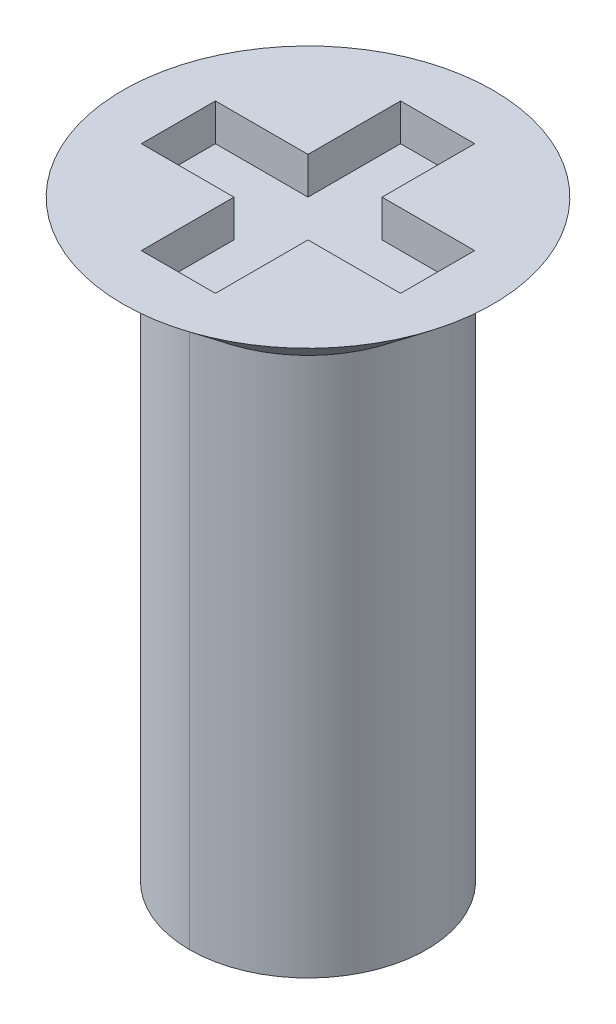
ISO-10303-21;
HEADER;
FILE_DESCRIPTION(('STEP AP214'),'2;1');
FILE_NAME('part.step','',(''),(''),'','','');
FILE_SCHEMA(('AUTOMOTIVE_DESIGN { 1 0 10303 214 1 1 1 1 }'));
ENDSEC;
DATA;
#1=APPLICATION_CONTEXT('core data for automotive mechanical design processes');
#2=APPLICATION_PROTOCOL_DEFINITION('international standard','automotive_design',2000,#1);
#3=PRODUCT_CONTEXT('',#1,'mechanical');
#4=PRODUCT('Part','Part','',(#3));
#5=PRODUCT_RELATED_PRODUCT_CATEGORY('part','',(#4));
#6=PRODUCT_DEFINITION_FORMATION('','',#4);
#7=PRODUCT_DEFINITION_CONTEXT('part definition',#1,'design');
#8=PRODUCT_DEFINITION('design','',#6,#7);
#9=PRODUCT_DEFINITION_SHAPE('','',#8);
#10=(LENGTH_UNIT() NAMED_UNIT(*) SI_UNIT(.MILLI.,.METRE.));
#11=(NAMED_UNIT(*) PLANE_ANGLE_UNIT() SI_UNIT($,.RADIAN.));
#12=(NAMED_UNIT(*) SI_UNIT($,.STERADIAN.) SOLID_ANGLE_UNIT());
#13=UNCERTAINTY_MEASURE_WITH_UNIT(LENGTH_MEASURE(1.E-05),#10,'distance_accuracy_value','');
#14=(GEOMETRIC_REPRESENTATION_CONTEXT(3) GLOBAL_UNCERTAINTY_ASSIGNED_CONTEXT((#13)) GLOBAL_UNIT_ASSIGNED_CONTEXT((#10,
#11,#12)) REPRESENTATION_CONTEXT('',''));
#15=CARTESIAN_POINT('',(0.,0.,0.));
#16=DIRECTION('',(0.,0.,1.));
#17=DIRECTION('',(1.,0.,0.));
#18=AXIS2_PLACEMENT_3D('',#15,#16,#17);
#19=CARTESIAN_POINT('',(-0.76,6.,0.76));
#20=DIRECTION('',(0.,-1.,0.));
#21=DIRECTION('',(0.,0.,-1.));
#22=AXIS2_PLACEMENT_3D('',#19,#20,#21);
#23=PLANE('',#22);
#24=CARTESIAN_POINT('',(0.,6.,0.));
#25=DIRECTION('',(0.,1.,0.));
#26=DIRECTION('',(0.,0.,-1.));
#27=AXIS2_PLACEMENT_3D('',#24,#25,#26);
#28=CIRCLE('',#27,0.8);
#29=CARTESIAN_POINT('',(0.,6.,-0.8));
#30=VERTEX_POINT('',#29);
#31=CARTESIAN_POINT('',(0.,6.,0.8));
#32=VERTEX_POINT('',#31);
#33=EDGE_CURVE('E11',#30,#32,#28,.T.);
#34=ORIENTED_EDGE('',*,*,#33,.F.);
#35=CARTESIAN_POINT('',(0.,6.,0.));
#36=DIRECTION('',(0.,1.,0.));
#37=DIRECTION('',(0.,0.,-1.));
#38=AXIS2_PLACEMENT_3D('',#35,#36,#37);
#39=CIRCLE('',#38,0.8);
#40=EDGE_CURVE('E206',#32,#30,#39,.T.);
#41=ORIENTED_EDGE('',*,*,#40,.F.);
#42=EDGE_LOOP('',(#34,#41));
#43=FACE_BOUND('',#42,.T.);
#44=ADVANCED_FACE('F16',(#43),#23,.T.);
#45=CARTESIAN_POINT('',(0.,9.6,0.));
#46=DIRECTION('',(0.,-1.,0.));
#47=DIRECTION('',(0.,0.,-1.));
#48=AXIS2_PLACEMENT_3D('',#45,#46,#47);
#49=CYLINDRICAL_SURFACE('',#48,0.8);
#50=DIRECTION('',(0.,-1.,0.));
#51=VECTOR('',#50,1.);
#52=CARTESIAN_POINT('',(0.,9.6,0.8));
#53=LINE('',#52,#51);
#54=CARTESIAN_POINT('',(0.,9.64,0.8));
#55=VERTEX_POINT('',#54);
#56=EDGE_CURVE('E177',#55,#32,#53,.T.);
#57=ORIENTED_EDGE('',*,*,#56,.F.);
#58=CARTESIAN_POINT('',(0.,9.64,0.));
#59=DIRECTION('',(0.,1.,0.));
#60=DIRECTION('',(0.,0.,1.));
#61=AXIS2_PLACEMENT_3D('',#58,#59,#60);
#62=CIRCLE('',#61,0.8);
#63=CARTESIAN_POINT('',(0.,9.64,-0.8));
#64=VERTEX_POINT('',#63);
#65=EDGE_CURVE('E27',#64,#55,#62,.T.);
#66=ORIENTED_EDGE('',*,*,#65,.F.);
#67=DIRECTION('',(0.,-1.,0.));
#68=VECTOR('',#67,1.);
#69=CARTESIAN_POINT('',(0.,9.6,-0.8));
#70=LINE('',#69,#68);
#71=EDGE_CURVE('E199',#64,#30,#70,.T.);
#72=ORIENTED_EDGE('',*,*,#71,.T.);
#73=ORIENTED_EDGE('',*,*,#33,.T.);
#74=EDGE_LOOP('',(#57,#66,#72,#73));
#75=FACE_BOUND('',#74,.T.);
#76=ADVANCED_FACE('F448',(#75),#49,.T.);
#77=CARTESIAN_POINT('',(0.,9.6,0.));
#78=DIRECTION('',(0.,1.,0.));
#79=DIRECTION('',(0.,0.,1.));
#80=AXIS2_PLACEMENT_3D('',#77,#78,#79);
#81=CONICAL_SURFACE('',#80,0.75,0.896055384571343);
#82=DIRECTION('',(0.,0.624695047554425,-0.78086880944303));
#83=VECTOR('',#82,1.);
#84=CARTESIAN_POINT('',(0.,9.6,-0.75));
#85=LINE('',#84,#83);
#86=CARTESIAN_POINT('',(0.,10.,-1.25));
#87=VERTEX_POINT('',#86);
#88=EDGE_CURVE('E203',#64,#87,#85,.T.);
#89=ORIENTED_EDGE('',*,*,#88,.F.);
#90=ORIENTED_EDGE('',*,*,#65,.T.);
#91=DIRECTION('',(0.,0.624695047554425,0.78086880944303));
#92=VECTOR('',#91,1.);
#93=CARTESIAN_POINT('',(0.,9.6,0.75));
#94=LINE('',#93,#92);
#95=CARTESIAN_POINT('',(0.,10.,1.25));
#96=VERTEX_POINT('',#95);
#97=EDGE_CURVE('E173',#55,#96,#94,.T.);
#98=ORIENTED_EDGE('',*,*,#97,.T.);
#99=CARTESIAN_POINT('',(0.,10.,0.));
#100=DIRECTION('',(0.,1.,0.));
#101=DIRECTION('',(0.,0.,1.));
#102=AXIS2_PLACEMENT_3D('',#99,#100,#101);
#103=CIRCLE('',#102,1.25);
#104=EDGE_CURVE('E150',#87,#96,#103,.T.);
#105=ORIENTED_EDGE('',*,*,#104,.F.);
#106=EDGE_LOOP('',(#89,#90,#98,#105));
#107=FACE_BOUND('',#106,.T.);
#108=ADVANCED_FACE('F413',(#107),#81,.T.);
#109=CARTESIAN_POINT('',(-0.885,10.01,0.25));
#110=DIRECTION('',(0.,0.,-1.));
#111=DIRECTION('',(0.,-1.,0.));
#112=AXIS2_PLACEMENT_3D('',#109,#110,#111);
#113=PLANE('',#112);
#114=DIRECTION('',(1.,0.,0.));
#115=VECTOR('',#114,1.);
#116=CARTESIAN_POINT('',(0.,9.75,0.25));
#117=LINE('',#116,#115);
#118=CARTESIAN_POINT('',(-0.875,9.75,0.25));
#119=VERTEX_POINT('',#118);
#120=CARTESIAN_POINT('',(-0.25,9.75,0.25));
#121=VERTEX_POINT('',#120);
#122=EDGE_CURVE('E185',#119,#121,#117,.T.);
#123=ORIENTED_EDGE('',*,*,#122,.F.);
#124=DIRECTION('',(0.,-1.,0.));
#125=VECTOR('',#124,1.);
#126=CARTESIAN_POINT('',(-0.875,9.875,0.25));
#127=LINE('',#126,#125);
#128=CARTESIAN_POINT('',(-0.875,10.,0.25));
#129=VERTEX_POINT('',#128);
#130=EDGE_CURVE('E146',#129,#119,#127,.T.);
#131=ORIENTED_EDGE('',*,*,#130,.F.);
#132=DIRECTION('',(-1.,0.,0.));
#133=VECTOR('',#132,1.);
#134=CARTESIAN_POINT('',(0.,10.,0.25));
#135=LINE('',#134,#133);
#136=CARTESIAN_POINT('',(-0.25,10.,0.25));
#137=VERTEX_POINT('',#136);
#138=EDGE_CURVE('E138',#137,#129,#135,.T.);
#139=ORIENTED_EDGE('',*,*,#138,.F.);
#140=DIRECTION('',(0.,1.,0.));
#141=VECTOR('',#140,1.);
#142=CARTESIAN_POINT('',(-0.25,9.875,0.25));
#143=LINE('',#142,#141);
#144=EDGE_CURVE('E121',#121,#137,#143,.T.);
#145=ORIENTED_EDGE('',*,*,#144,.F.);
#146=EDGE_LOOP('',(#123,#131,#139,#145));
#147=FACE_BOUND('',#146,.T.);
#148=ADVANCED_FACE('F145',(#147),#113,.T.);
#149=CARTESIAN_POINT('',(-0.25,10.01,0.24));
#150=DIRECTION('',(1.,0.,0.));
#151=DIRECTION('',(0.,1.,0.));
#152=AXIS2_PLACEMENT_3D('',#149,#150,#151);
#153=PLANE('',#152);
#154=DIRECTION('',(0.,0.,1.));
#155=VECTOR('',#154,1.);
#156=CARTESIAN_POINT('',(-0.25,9.75,0.));
#157=LINE('',#156,#155);
#158=CARTESIAN_POINT('',(-0.25,9.75,0.875));
#159=VERTEX_POINT('',#158);
#160=EDGE_CURVE('E127',#121,#159,#157,.T.);
#161=ORIENTED_EDGE('',*,*,#160,.F.);
#162=ORIENTED_EDGE('',*,*,#144,.T.);
#163=DIRECTION('',(0.,0.,-1.));
#164=VECTOR('',#163,1.);
#165=CARTESIAN_POINT('',(-0.25,10.,0.));
#166=LINE('',#165,#164);
#167=CARTESIAN_POINT('',(-0.25,10.,0.875));
#168=VERTEX_POINT('',#167);
#169=EDGE_CURVE('E124',#168,#137,#166,.T.);
#170=ORIENTED_EDGE('',*,*,#169,.F.);
#171=DIRECTION('',(0.,1.,0.));
#172=VECTOR('',#171,1.);
#173=CARTESIAN_POINT('',(-0.25,9.875,0.875));
#174=LINE('',#173,#172);
#175=EDGE_CURVE('E42',#159,#168,#174,.T.);
#176=ORIENTED_EDGE('',*,*,#175,.F.);
#177=EDGE_LOOP('',(#161,#162,#170,#176));
#178=FACE_BOUND('',#177,.T.);
#179=ADVANCED_FACE('F123',(#178),#153,.T.);
#180=CARTESIAN_POINT('',(-0.26,10.01,0.875));
#181=DIRECTION('',(0.,0.,-1.));
#182=DIRECTION('',(0.,-1.,0.));
#183=AXIS2_PLACEMENT_3D('',#180,#181,#182);
#184=PLANE('',#183);
#185=DIRECTION('',(1.,0.,0.));
#186=VECTOR('',#185,1.);
#187=CARTESIAN_POINT('',(0.,9.75,0.875));
#188=LINE('',#187,#186);
#189=CARTESIAN_POINT('',(0.25,9.75,0.875));
#190=VERTEX_POINT('',#189);
#191=EDGE_CURVE('E281',#159,#190,#188,.T.);
#192=ORIENTED_EDGE('',*,*,#191,.F.);
#193=ORIENTED_EDGE('',*,*,#175,.T.);
#194=DIRECTION('',(-1.,0.,0.));
#195=VECTOR('',#194,1.);
#196=CARTESIAN_POINT('',(0.,10.,0.875));
#197=LINE('',#196,#195);
#198=CARTESIAN_POINT('',(0.25,10.,0.875));
#199=VERTEX_POINT('',#198);
#200=EDGE_CURVE('E141',#199,#168,#197,.T.);
#201=ORIENTED_EDGE('',*,*,#200,.F.);
#202=DIRECTION('',(0.,1.,0.));
#203=VECTOR('',#202,1.);
#204=CARTESIAN_POINT('',(0.25,9.875,0.875));
#205=LINE('',#204,#203);
#206=EDGE_CURVE('E221',#190,#199,#205,.T.);
#207=ORIENTED_EDGE('',*,*,#206,.F.);
#208=EDGE_LOOP('',(#192,#193,#201,#207));
#209=FACE_BOUND('',#208,.T.);
#210=ADVANCED_FACE('F508',(#209),#184,.T.);
#211=CARTESIAN_POINT('',(0.25,10.01,0.885));
#212=DIRECTION('',(-1.,0.,0.));
#213=DIRECTION('',(0.,0.,1.));
#214=AXIS2_PLACEMENT_3D('',#211,#212,#213);
#215=PLANE('',#214);
#216=DIRECTION('',(0.,0.,-1.));
#217=VECTOR('',#216,1.);
#218=CARTESIAN_POINT('',(0.25,9.75,0.));
#219=LINE('',#218,#217);
#220=CARTESIAN_POINT('',(0.25,9.75,0.25));
#221=VERTEX_POINT('',#220);
#222=EDGE_CURVE('E251',#190,#221,#219,.T.);
#223=ORIENTED_EDGE('',*,*,#222,.F.);
#224=ORIENTED_EDGE('',*,*,#206,.T.);
#225=DIRECTION('',(0.,0.,1.));
#226=VECTOR('',#225,1.);
#227=CARTESIAN_POINT('',(0.25,10.,0.));
#228=LINE('',#227,#226);
#229=CARTESIAN_POINT('',(0.25,10.,0.25));
#230=VERTEX_POINT('',#229);
#231=EDGE_CURVE('E242',#230,#199,#228,.T.);
#232=ORIENTED_EDGE('',*,*,#231,.F.);
#233=DIRECTION('',(0.,1.,0.));
#234=VECTOR('',#233,1.);
#235=CARTESIAN_POINT('',(0.25,9.875,0.25));
#236=LINE('',#235,#234);
#237=EDGE_CURVE('E210',#221,#230,#236,.T.);
#238=ORIENTED_EDGE('',*,*,#237,.F.);
#239=EDGE_LOOP('',(#223,#224,#232,#238));
#240=FACE_BOUND('',#239,.T.);
#241=ADVANCED_FACE('F317',(#240),#215,.T.);
#242=CARTESIAN_POINT('',(0.24,10.01,0.25));
#243=DIRECTION('',(0.,0.,-1.));
#244=DIRECTION('',(0.,-1.,0.));
#245=AXIS2_PLACEMENT_3D('',#242,#243,#244);
#246=PLANE('',#245);
#247=DIRECTION('',(1.,0.,0.));
#248=VECTOR('',#247,1.);
#249=CARTESIAN_POINT('',(0.,9.75,0.25));
#250=LINE('',#249,#248);
#251=CARTESIAN_POINT('',(0.875,9.75,0.25));
#252=VERTEX_POINT('',#251);
#253=EDGE_CURVE('E248',#221,#252,#250,.T.);
#254=ORIENTED_EDGE('',*,*,#253,.F.);
#255=ORIENTED_EDGE('',*,*,#237,.T.);
#256=DIRECTION('',(-1.,0.,0.));
#257=VECTOR('',#256,1.);
#258=CARTESIAN_POINT('',(0.,10.,0.25));
#259=LINE('',#258,#257);
#260=CARTESIAN_POINT('',(0.875,10.,0.25));
#261=VERTEX_POINT('',#260);
#262=EDGE_CURVE('E257',#261,#230,#259,.T.);
#263=ORIENTED_EDGE('',*,*,#262,.F.);
#264=DIRECTION('',(0.,1.,0.));
#265=VECTOR('',#264,1.);
#266=CARTESIAN_POINT('',(0.875,9.875,0.25));
#267=LINE('',#266,#265);
#268=EDGE_CURVE('E207',#252,#261,#267,.T.);
#269=ORIENTED_EDGE('',*,*,#268,.F.);
#270=EDGE_LOOP('',(#254,#255,#263,#269));
#271=FACE_BOUND('',#270,.T.);
#272=ADVANCED_FACE('F320',(#271),#246,.T.);
#273=CARTESIAN_POINT('',(0.875,10.01,0.26));
#274=DIRECTION('',(-1.,0.,0.));
#275=DIRECTION('',(0.,0.,1.));
#276=AXIS2_PLACEMENT_3D('',#273,#274,#275);
#277=PLANE('',#276);
#278=DIRECTION('',(0.,0.,-1.));
#279=VECTOR('',#278,1.);
#280=CARTESIAN_POINT('',(0.875,9.75,0.));
#281=LINE('',#280,#279);
#282=CARTESIAN_POINT('',(0.875,9.75,-0.25));
#283=VERTEX_POINT('',#282);
#284=EDGE_CURVE('E194',#252,#283,#281,.T.);
#285=ORIENTED_EDGE('',*,*,#284,.F.);
#286=ORIENTED_EDGE('',*,*,#268,.T.);
#287=DIRECTION('',(0.,0.,1.));
#288=VECTOR('',#287,1.);
#289=CARTESIAN_POINT('',(0.875,10.,0.));
#290=LINE('',#289,#288);
#291=CARTESIAN_POINT('',(0.875,10.,-0.25));
#292=VERTEX_POINT('',#291);
#293=EDGE_CURVE('E253',#292,#261,#290,.T.);
#294=ORIENTED_EDGE('',*,*,#293,.F.);
#295=DIRECTION('',(0.,1.,0.));
#296=VECTOR('',#295,1.);
#297=CARTESIAN_POINT('',(0.875,9.875,-0.25));
#298=LINE('',#297,#296);
#299=EDGE_CURVE('E211',#283,#292,#298,.T.);
#300=ORIENTED_EDGE('',*,*,#299,.F.);
#301=EDGE_LOOP('',(#285,#286,#294,#300));
#302=FACE_BOUND('',#301,.T.);
#303=ADVANCED_FACE('F323',(#302),#277,.T.);
#304=CARTESIAN_POINT('',(0.885,10.01,-0.25));
#305=DIRECTION('',(0.,0.,1.));
#306=DIRECTION('',(1.,0.,0.));
#307=AXIS2_PLACEMENT_3D('',#304,#305,#306);
#308=PLANE('',#307);
#309=DIRECTION('',(-1.,0.,0.));
#310=VECTOR('',#309,1.);
#311=CARTESIAN_POINT('',(0.,9.75,-0.25));
#312=LINE('',#311,#310);
#313=CARTESIAN_POINT('',(0.25,9.75,-0.25));
#314=VERTEX_POINT('',#313);
#315=EDGE_CURVE('E189',#283,#314,#312,.T.);
#316=ORIENTED_EDGE('',*,*,#315,.F.);
#317=ORIENTED_EDGE('',*,*,#299,.T.);
#318=DIRECTION('',(1.,0.,0.));
#319=VECTOR('',#318,1.);
#320=CARTESIAN_POINT('',(0.,10.,-0.25));
#321=LINE('',#320,#319);
#322=CARTESIAN_POINT('',(0.25,10.,-0.25));
#323=VERTEX_POINT('',#322);
#324=EDGE_CURVE('E20',#323,#292,#321,.T.);
#325=ORIENTED_EDGE('',*,*,#324,.F.);
#326=DIRECTION('',(0.,1.,0.));
#327=VECTOR('',#326,1.);
#328=CARTESIAN_POINT('',(0.25,9.875,-0.25));
#329=LINE('',#328,#327);
#330=EDGE_CURVE('E224',#314,#323,#329,.T.);
#331=ORIENTED_EDGE('',*,*,#330,.F.);
#332=EDGE_LOOP('',(#316,#317,#325,#331));
#333=FACE_BOUND('',#332,.T.);
#334=ADVANCED_FACE('F432',(#333),#308,.T.);
#335=CARTESIAN_POINT('',(0.25,10.01,-0.24));
#336=DIRECTION('',(-1.,0.,0.));
#337=DIRECTION('',(0.,0.,1.));
#338=AXIS2_PLACEMENT_3D('',#335,#336,#337);
#339=PLANE('',#338);
#340=DIRECTION('',(0.,0.,-1.));
#341=VECTOR('',#340,1.);
#342=CARTESIAN_POINT('',(0.25,9.75,0.));
#343=LINE('',#342,#341);
#344=CARTESIAN_POINT('',(0.25,9.75,-0.875));
#345=VERTEX_POINT('',#344);
#346=EDGE_CURVE('E165',#314,#345,#343,.T.);
#347=ORIENTED_EDGE('',*,*,#346,.F.);
#348=ORIENTED_EDGE('',*,*,#330,.T.);
#349=DIRECTION('',(0.,0.,1.));
#350=VECTOR('',#349,1.);
#351=CARTESIAN_POINT('',(0.25,10.,0.));
#352=LINE('',#351,#350);
#353=CARTESIAN_POINT('',(0.25,10.,-0.875));
#354=VERTEX_POINT('',#353);
#355=EDGE_CURVE('E157',#354,#323,#352,.T.);
#356=ORIENTED_EDGE('',*,*,#355,.F.);
#357=DIRECTION('',(0.,1.,0.));
#358=VECTOR('',#357,1.);
#359=CARTESIAN_POINT('',(0.25,9.875,-0.875));
#360=LINE('',#359,#358);
#361=EDGE_CURVE('E143',#345,#354,#360,.T.);
#362=ORIENTED_EDGE('',*,*,#361,.F.);
#363=EDGE_LOOP('',(#347,#348,#356,#362));
#364=FACE_BOUND('',#363,.T.);
#365=ADVANCED_FACE('F427',(#364),#339,.T.);
#366=CARTESIAN_POINT('',(0.26,10.01,-0.875));
#367=DIRECTION('',(0.,0.,1.));
#368=DIRECTION('',(1.,0.,0.));
#369=AXIS2_PLACEMENT_3D('',#366,#367,#368);
#370=PLANE('',#369);
#371=DIRECTION('',(-1.,0.,0.));
#372=VECTOR('',#371,1.);
#373=CARTESIAN_POINT('',(0.,9.75,-0.875));
#374=LINE('',#373,#372);
#375=CARTESIAN_POINT('',(-0.25,9.75,-0.875));
#376=VERTEX_POINT('',#375);
#377=EDGE_CURVE('E169',#345,#376,#374,.T.);
#378=ORIENTED_EDGE('',*,*,#377,.F.);
#379=ORIENTED_EDGE('',*,*,#361,.T.);
#380=DIRECTION('',(1.,0.,0.));
#381=VECTOR('',#380,1.);
#382=CARTESIAN_POINT('',(0.,10.,-0.875));
#383=LINE('',#382,#381);
#384=CARTESIAN_POINT('',(-0.25,10.,-0.875));
#385=VERTEX_POINT('',#384);
#386=EDGE_CURVE('E149',#385,#354,#383,.T.);
#387=ORIENTED_EDGE('',*,*,#386,.F.);
#388=DIRECTION('',(0.,1.,0.));
#389=VECTOR('',#388,1.);
#390=CARTESIAN_POINT('',(-0.25,9.875,-0.875));
#391=LINE('',#390,#389);
#392=EDGE_CURVE('E261',#376,#385,#391,.T.);
#393=ORIENTED_EDGE('',*,*,#392,.F.);
#394=EDGE_LOOP('',(#378,#379,#387,#393));
#395=FACE_BOUND('',#394,.T.);
#396=ADVANCED_FACE('F431',(#395),#370,.T.);
#397=CARTESIAN_POINT('',(-1.26,10.,-1.26));
#398=DIRECTION('',(0.,1.,0.));
#399=DIRECTION('',(1.,0.,0.));
#400=AXIS2_PLACEMENT_3D('',#397,#398,#399);
#401=PLANE('',#400);
#402=ORIENTED_EDGE('',*,*,#138,.T.);
#403=DIRECTION('',(0.,0.,1.));
#404=VECTOR('',#403,1.);
#405=CARTESIAN_POINT('',(-0.875,10.,0.));
#406=LINE('',#405,#404);
#407=CARTESIAN_POINT('',(-0.875,10.,-0.25));
#408=VERTEX_POINT('',#407);
#409=EDGE_CURVE('E193',#408,#129,#406,.T.);
#410=ORIENTED_EDGE('',*,*,#409,.F.);
#411=DIRECTION('',(-1.,0.,0.));
#412=VECTOR('',#411,1.);
#413=CARTESIAN_POINT('',(-0.5625,10.,-0.25));
#414=LINE('',#413,#412);
#415=CARTESIAN_POINT('',(-0.25,10.,-0.25));
#416=VERTEX_POINT('',#415);
#417=EDGE_CURVE('E179',#416,#408,#414,.T.);
#418=ORIENTED_EDGE('',*,*,#417,.F.);
#419=DIRECTION('',(0.,0.,1.));
#420=VECTOR('',#419,1.);
#421=CARTESIAN_POINT('',(-0.25,10.,-0.5625));
#422=LINE('',#421,#420);
#423=EDGE_CURVE('E170',#385,#416,#422,.T.);
#424=ORIENTED_EDGE('',*,*,#423,.F.);
#425=ORIENTED_EDGE('',*,*,#386,.T.);
#426=ORIENTED_EDGE('',*,*,#355,.T.);
#427=ORIENTED_EDGE('',*,*,#324,.T.);
#428=ORIENTED_EDGE('',*,*,#293,.T.);
#429=ORIENTED_EDGE('',*,*,#262,.T.);
#430=ORIENTED_EDGE('',*,*,#231,.T.);
#431=ORIENTED_EDGE('',*,*,#200,.T.);
#432=ORIENTED_EDGE('',*,*,#169,.T.);
#433=EDGE_LOOP('',(#402,#410,#418,#424,#425,#426,#427,#428,#429,#430,#431,#432));
#434=FACE_BOUND('',#433,.T.);
#435=CARTESIAN_POINT('',(0.,10.,0.));
#436=DIRECTION('',(0.,1.,0.));
#437=DIRECTION('',(0.,0.,1.));
#438=AXIS2_PLACEMENT_3D('',#435,#436,#437);
#439=CIRCLE('',#438,1.25);
#440=EDGE_CURVE('E178',#96,#87,#439,.T.);
#441=ORIENTED_EDGE('',*,*,#440,.T.);
#442=ORIENTED_EDGE('',*,*,#104,.T.);
#443=EDGE_LOOP('',(#441,#442));
#444=FACE_BOUND('',#443,.T.);
#445=ADVANCED_FACE('F135',(#434,#444),#401,.T.);
#446=CARTESIAN_POINT('',(-0.875,10.01,-0.26));
#447=DIRECTION('',(1.,0.,0.));
#448=DIRECTION('',(0.,1.,0.));
#449=AXIS2_PLACEMENT_3D('',#446,#447,#448);
#450=PLANE('',#449);
#451=DIRECTION('',(0.,0.,1.));
#452=VECTOR('',#451,1.);
#453=CARTESIAN_POINT('',(-0.875,9.75,0.));
#454=LINE('',#453,#452);
#455=CARTESIAN_POINT('',(-0.875,9.75,-0.25));
#456=VERTEX_POINT('',#455);
#457=EDGE_CURVE('E188',#456,#119,#454,.T.);
#458=ORIENTED_EDGE('',*,*,#457,.F.);
#459=DIRECTION('',(0.,-1.,0.));
#460=VECTOR('',#459,1.);
#461=CARTESIAN_POINT('',(-0.875,9.875,-0.25));
#462=LINE('',#461,#460);
#463=EDGE_CURVE('E183',#408,#456,#462,.T.);
#464=ORIENTED_EDGE('',*,*,#463,.F.);
#465=ORIENTED_EDGE('',*,*,#409,.T.);
#466=ORIENTED_EDGE('',*,*,#130,.T.);
#467=EDGE_LOOP('',(#458,#464,#465,#466));
#468=FACE_BOUND('',#467,.T.);
#469=ADVANCED_FACE('F422',(#468),#450,.T.);
#470=CARTESIAN_POINT('',(-0.885,9.75,-0.885));
#471=DIRECTION('',(0.,1.,0.));
#472=DIRECTION('',(1.,0.,0.));
#473=AXIS2_PLACEMENT_3D('',#470,#471,#472);
#474=PLANE('',#473);
#475=ORIENTED_EDGE('',*,*,#346,.T.);
#476=ORIENTED_EDGE('',*,*,#377,.T.);
#477=DIRECTION('',(0.,0.,-1.));
#478=VECTOR('',#477,1.);
#479=CARTESIAN_POINT('',(-0.25,9.75,-0.5625));
#480=LINE('',#479,#478);
#481=CARTESIAN_POINT('',(-0.25,9.75,-0.25));
#482=VERTEX_POINT('',#481);
#483=EDGE_CURVE('E270',#482,#376,#480,.T.);
#484=ORIENTED_EDGE('',*,*,#483,.F.);
#485=DIRECTION('',(1.,0.,0.));
#486=VECTOR('',#485,1.);
#487=CARTESIAN_POINT('',(-0.5625,9.75,-0.25));
#488=LINE('',#487,#486);
#489=EDGE_CURVE('E195',#456,#482,#488,.T.);
#490=ORIENTED_EDGE('',*,*,#489,.F.);
#491=ORIENTED_EDGE('',*,*,#457,.T.);
#492=ORIENTED_EDGE('',*,*,#122,.T.);
#493=ORIENTED_EDGE('',*,*,#160,.T.);
#494=ORIENTED_EDGE('',*,*,#191,.T.);
#495=ORIENTED_EDGE('',*,*,#222,.T.);
#496=ORIENTED_EDGE('',*,*,#253,.T.);
#497=ORIENTED_EDGE('',*,*,#284,.T.);
#498=ORIENTED_EDGE('',*,*,#315,.T.);
#499=EDGE_LOOP('',(#475,#476,#484,#490,#491,#492,#493,#494,#495,#496,#497,#498));
#500=FACE_BOUND('',#499,.T.);
#501=ADVANCED_FACE('F310',(#500),#474,.T.);
#502=CARTESIAN_POINT('',(-0.25,10.01,-0.885));
#503=DIRECTION('',(1.,0.,0.));
#504=DIRECTION('',(0.,1.,0.));
#505=AXIS2_PLACEMENT_3D('',#502,#503,#504);
#506=PLANE('',#505);
#507=ORIENTED_EDGE('',*,*,#483,.T.);
#508=ORIENTED_EDGE('',*,*,#392,.T.);
#509=ORIENTED_EDGE('',*,*,#423,.T.);
#510=DIRECTION('',(0.,1.,0.));
#511=VECTOR('',#510,1.);
#512=CARTESIAN_POINT('',(-0.25,9.875,-0.25));
#513=LINE('',#512,#511);
#514=EDGE_CURVE('E184',#482,#416,#513,.T.);
#515=ORIENTED_EDGE('',*,*,#514,.F.);
#516=EDGE_LOOP('',(#507,#508,#509,#515));
#517=FACE_BOUND('',#516,.T.);
#518=ADVANCED_FACE('F421',(#517),#506,.T.);
#519=CARTESIAN_POINT('',(-0.24,10.01,-0.25));
#520=DIRECTION('',(0.,0.,1.));
#521=DIRECTION('',(1.,0.,0.));
#522=AXIS2_PLACEMENT_3D('',#519,#520,#521);
#523=PLANE('',#522);
#524=ORIENTED_EDGE('',*,*,#489,.T.);
#525=ORIENTED_EDGE('',*,*,#514,.T.);
#526=ORIENTED_EDGE('',*,*,#417,.T.);
#527=ORIENTED_EDGE('',*,*,#463,.T.);
#528=EDGE_LOOP('',(#524,#525,#526,#527));
#529=FACE_BOUND('',#528,.T.);
#530=ADVANCED_FACE('F477',(#529),#523,.T.);
#531=CARTESIAN_POINT('',(0.,9.6,0.));
#532=DIRECTION('',(0.,-1.,0.));
#533=DIRECTION('',(0.,0.,-1.));
#534=AXIS2_PLACEMENT_3D('',#531,#532,#533);
#535=CYLINDRICAL_SURFACE('',#534,0.8);
#536=CARTESIAN_POINT('',(0.,9.64,0.));
#537=DIRECTION('',(0.,1.,0.));
#538=DIRECTION('',(0.,0.,1.));
#539=AXIS2_PLACEMENT_3D('',#536,#537,#538);
#540=CIRCLE('',#539,0.8);
#541=EDGE_CURVE('E288',#55,#64,#540,.T.);
#542=ORIENTED_EDGE('',*,*,#541,.F.);
#543=ORIENTED_EDGE('',*,*,#56,.T.);
#544=ORIENTED_EDGE('',*,*,#40,.T.);
#545=ORIENTED_EDGE('',*,*,#71,.F.);
#546=EDGE_LOOP('',(#542,#543,#544,#545));
#547=FACE_BOUND('',#546,.T.);
#548=ADVANCED_FACE('F18',(#547),#535,.T.);
#549=CARTESIAN_POINT('',(0.,9.6,0.));
#550=DIRECTION('',(0.,1.,0.));
#551=DIRECTION('',(0.,0.,1.));
#552=AXIS2_PLACEMENT_3D('',#549,#550,#551);
#553=CONICAL_SURFACE('',#552,0.75,0.896055384571343);
#554=ORIENTED_EDGE('',*,*,#541,.T.);
#555=ORIENTED_EDGE('',*,*,#88,.T.);
#556=ORIENTED_EDGE('',*,*,#440,.F.);
#557=ORIENTED_EDGE('',*,*,#97,.F.);
#558=EDGE_LOOP('',(#554,#555,#556,#557));
#559=FACE_BOUND('',#558,.T.);
#560=ADVANCED_FACE('F545',(#559),#553,.T.);
#561=CLOSED_SHELL('',(#44,#76,#108,#148,#179,#210,#241,#272,#303,#334,#365,#396,#445,#469,#501,
#518,#530,#548,#560));
#562=MANIFOLD_SOLID_BREP('B1',#561);
#563=ADVANCED_BREP_SHAPE_REPRESENTATION('',(#18,#562),#14);
#564=SHAPE_DEFINITION_REPRESENTATION(#9,#563);
ENDSEC;
END-ISO-10303-21;
